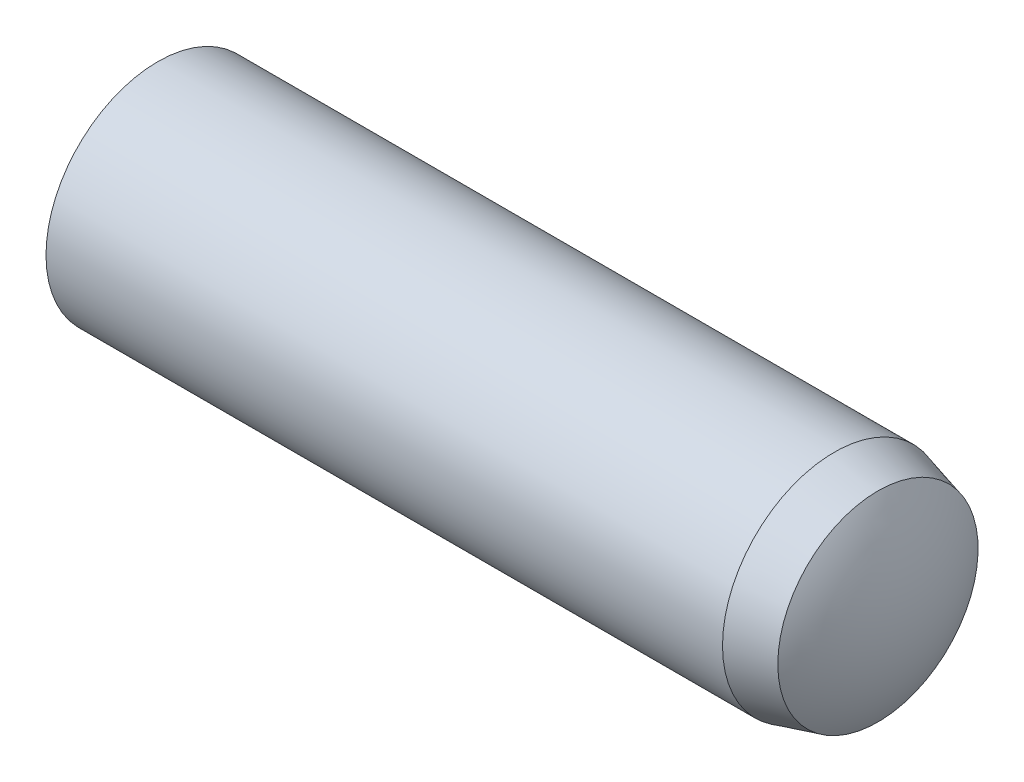
ISO-10303-21;
HEADER;
FILE_DESCRIPTION(('STEP AP214'),'2;1');
FILE_NAME('part.step','',(''),(''),'','','');
FILE_SCHEMA(('AUTOMOTIVE_DESIGN { 1 0 10303 214 1 1 1 1 }'));
ENDSEC;
DATA;
#1=APPLICATION_CONTEXT('core data for automotive mechanical design processes');
#2=APPLICATION_PROTOCOL_DEFINITION('international standard','automotive_design',2000,#1);
#3=PRODUCT_CONTEXT('',#1,'mechanical');
#4=PRODUCT('Part','Part','',(#3));
#5=PRODUCT_RELATED_PRODUCT_CATEGORY('part','',(#4));
#6=PRODUCT_DEFINITION_FORMATION('','',#4);
#7=PRODUCT_DEFINITION_CONTEXT('part definition',#1,'design');
#8=PRODUCT_DEFINITION('design','',#6,#7);
#9=PRODUCT_DEFINITION_SHAPE('','',#8);
#10=(LENGTH_UNIT() NAMED_UNIT(*) SI_UNIT(.MILLI.,.METRE.));
#11=(NAMED_UNIT(*) PLANE_ANGLE_UNIT() SI_UNIT($,.RADIAN.));
#12=(NAMED_UNIT(*) SI_UNIT($,.STERADIAN.) SOLID_ANGLE_UNIT());
#13=UNCERTAINTY_MEASURE_WITH_UNIT(LENGTH_MEASURE(1.E-05),#10,'distance_accuracy_value','');
#14=(GEOMETRIC_REPRESENTATION_CONTEXT(3) GLOBAL_UNCERTAINTY_ASSIGNED_CONTEXT((#13)) GLOBAL_UNIT_ASSIGNED_CONTEXT((#10,
#11,#12)) REPRESENTATION_CONTEXT('',''));
#15=CARTESIAN_POINT('',(0.,0.,0.));
#16=DIRECTION('',(0.,0.,1.));
#17=DIRECTION('',(1.,0.,0.));
#18=AXIS2_PLACEMENT_3D('',#15,#16,#17);
#19=CARTESIAN_POINT('',(-14.,0.,0.));
#20=DIRECTION('',(1.,0.,0.));
#21=DIRECTION('',(0.,0.,-1.));
#22=AXIS2_PLACEMENT_3D('',#19,#20,#21);
#23=CYLINDRICAL_SURFACE('',#22,4.);
#24=CARTESIAN_POINT('',(11.4,0.,0.));
#25=DIRECTION('',(-1.,0.,0.));
#26=DIRECTION('',(0.,0.,1.));
#27=AXIS2_PLACEMENT_3D('',#24,#25,#26);
#28=CIRCLE('',#27,3.99999999999999);
#29=CARTESIAN_POINT('',(11.4,0.,3.99999999999999));
#30=VERTEX_POINT('',#29);
#31=EDGE_CURVE('E11',#30,#30,#28,.T.);
#32=ORIENTED_EDGE('',*,*,#31,.T.);
#33=EDGE_LOOP('',(#32));
#34=FACE_BOUND('',#33,.T.);
#35=CARTESIAN_POINT('',(-12.8,0.,0.));
#36=DIRECTION('',(-1.,0.,0.));
#37=DIRECTION('',(0.,0.,1.));
#38=AXIS2_PLACEMENT_3D('',#35,#36,#37);
#39=CIRCLE('',#38,4.);
#40=CARTESIAN_POINT('',(-12.8,0.,4.));
#41=VERTEX_POINT('',#40);
#42=EDGE_CURVE('E51',#41,#41,#39,.T.);
#43=ORIENTED_EDGE('',*,*,#42,.F.);
#44=EDGE_LOOP('',(#43));
#45=FACE_BOUND('',#44,.T.);
#46=ADVANCED_FACE('F31',(#34,#45),#23,.T.);
#47=CARTESIAN_POINT('',(11.4,0.,0.));
#48=DIRECTION('',(-1.,0.,0.));
#49=DIRECTION('',(0.,0.,1.));
#50=AXIS2_PLACEMENT_3D('',#47,#48,#49);
#51=CONICAL_SURFACE('',#50,3.99999999999999,0.26179938779915);
#52=CARTESIAN_POINT('',(12.96,0.,0.));
#53=DIRECTION('',(-1.,0.,0.));
#54=DIRECTION('',(0.,0.,1.));
#55=AXIS2_PLACEMENT_3D('',#52,#53,#54);
#56=CIRCLE('',#55,3.58199925980744);
#57=CARTESIAN_POINT('',(12.96,0.,3.58199925980744));
#58=VERTEX_POINT('',#57);
#59=EDGE_CURVE('E38',#58,#58,#56,.T.);
#60=ORIENTED_EDGE('',*,*,#59,.T.);
#61=EDGE_LOOP('',(#60));
#62=FACE_BOUND('',#61,.T.);
#63=ORIENTED_EDGE('',*,*,#31,.F.);
#64=EDGE_LOOP('',(#63));
#65=FACE_BOUND('',#64,.T.);
#66=ADVANCED_FACE('F57',(#62,#65),#51,.T.);
#67=CARTESIAN_POINT('',(7.31138524170139,0.,0.));
#68=DIRECTION('',(-1.,0.,0.));
#69=DIRECTION('',(0.,1.,0.));
#70=AXIS2_PLACEMENT_3D('',#67,#68,#69);
#71=SPHERICAL_SURFACE('',#70,6.68861475829861);
#72=CARTESIAN_POINT('',(14.,0.,0.));
#73=VERTEX_POINT('',#72);
#74=VERTEX_LOOP('',#73);
#75=FACE_BOUND('',#74,.T.);
#76=ORIENTED_EDGE('',*,*,#59,.F.);
#77=EDGE_LOOP('',(#76));
#78=FACE_BOUND('',#77,.T.);
#79=ADVANCED_FACE('F47',(#75,#78),#71,.T.);
#80=CARTESIAN_POINT('',(-6.73333333333333,0.,0.));
#81=DIRECTION('',(-1.,0.,0.));
#82=DIRECTION('',(0.,1.,0.));
#83=AXIS2_PLACEMENT_3D('',#80,#81,#82);
#84=SPHERICAL_SURFACE('',#83,7.26666666666667);
#85=CARTESIAN_POINT('',(-14.,0.,0.));
#86=VERTEX_POINT('',#85);
#87=VERTEX_LOOP('',#86);
#88=FACE_BOUND('',#87,.T.);
#89=ORIENTED_EDGE('',*,*,#42,.T.);
#90=EDGE_LOOP('',(#89));
#91=FACE_BOUND('',#90,.T.);
#92=ADVANCED_FACE('F44',(#88,#91),#84,.T.);
#93=CLOSED_SHELL('',(#46,#66,#79,#92));
#94=MANIFOLD_SOLID_BREP('B2',#93);
#95=ADVANCED_BREP_SHAPE_REPRESENTATION('',(#18,#94),#14);
#96=SHAPE_DEFINITION_REPRESENTATION(#9,#95);
ENDSEC;
END-ISO-10303-21;
